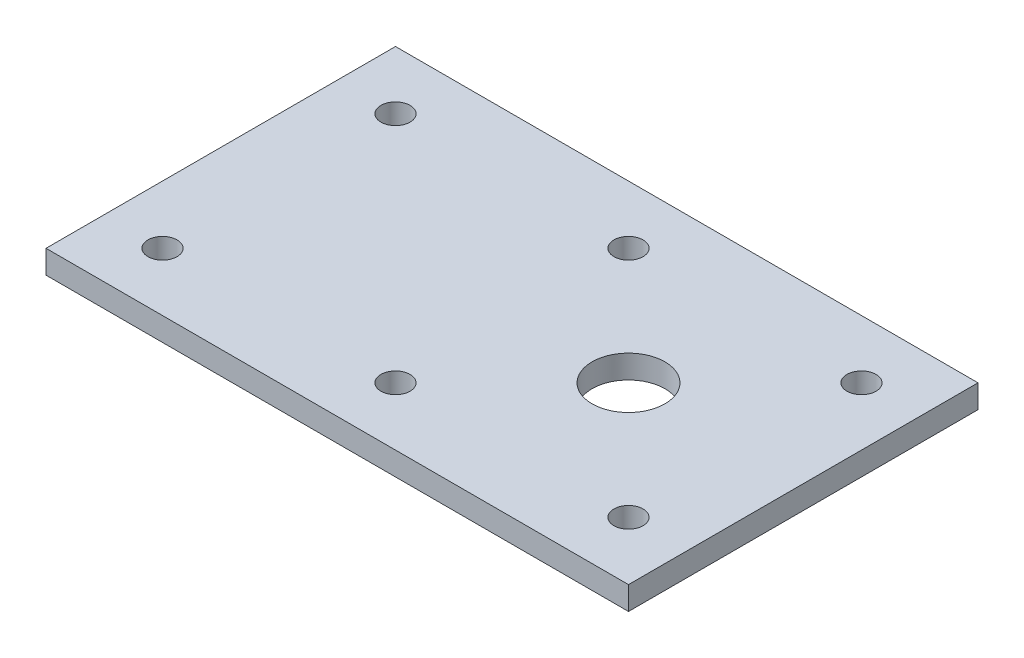
ISO-10303-21;
HEADER;
FILE_DESCRIPTION(('STEP AP214'),'2;1');
FILE_NAME('part.step','',(''),(''),'','','');
FILE_SCHEMA(('AUTOMOTIVE_DESIGN { 1 0 10303 214 1 1 1 1 }'));
ENDSEC;
DATA;
#1=APPLICATION_CONTEXT('core data for automotive mechanical design processes');
#2=APPLICATION_PROTOCOL_DEFINITION('international standard','automotive_design',2000,#1);
#3=PRODUCT_CONTEXT('',#1,'mechanical');
#4=PRODUCT('Part','Part','',(#3));
#5=PRODUCT_RELATED_PRODUCT_CATEGORY('part','',(#4));
#6=PRODUCT_DEFINITION_FORMATION('','',#4);
#7=PRODUCT_DEFINITION_CONTEXT('part definition',#1,'design');
#8=PRODUCT_DEFINITION('design','',#6,#7);
#9=PRODUCT_DEFINITION_SHAPE('','',#8);
#10=(LENGTH_UNIT() NAMED_UNIT(*) SI_UNIT(.MILLI.,.METRE.));
#11=(NAMED_UNIT(*) PLANE_ANGLE_UNIT() SI_UNIT($,.RADIAN.));
#12=(NAMED_UNIT(*) SI_UNIT($,.STERADIAN.) SOLID_ANGLE_UNIT());
#13=UNCERTAINTY_MEASURE_WITH_UNIT(LENGTH_MEASURE(1.E-05),#10,'distance_accuracy_value','');
#14=(GEOMETRIC_REPRESENTATION_CONTEXT(3) GLOBAL_UNCERTAINTY_ASSIGNED_CONTEXT((#13)) GLOBAL_UNIT_ASSIGNED_CONTEXT((#10,
#11,#12)) REPRESENTATION_CONTEXT('',''));
#15=CARTESIAN_POINT('',(0.,0.,0.));
#16=DIRECTION('',(0.,0.,1.));
#17=DIRECTION('',(1.,0.,0.));
#18=AXIS2_PLACEMENT_3D('',#15,#16,#17);
#19=CARTESIAN_POINT('',(89.6408317580341,0.,60.1134215500945));
#20=DIRECTION('',(0.,1.,0.));
#21=DIRECTION('',(0.,0.,1.));
#22=AXIS2_PLACEMENT_3D('',#19,#20,#21);
#23=CYLINDRICAL_SURFACE('',#22,5.);
#24=CARTESIAN_POINT('',(89.6408317580341,0.,60.1134215500945));
#25=DIRECTION('',(0.,1.,0.));
#26=DIRECTION('',(0.,0.,1.));
#27=AXIS2_PLACEMENT_3D('',#24,#25,#26);
#28=CIRCLE('',#27,5.);
#29=CARTESIAN_POINT('',(89.6408317580341,0.,65.1134215500945));
#30=VERTEX_POINT('',#29);
#31=EDGE_CURVE('E50',#30,#30,#28,.T.);
#32=ORIENTED_EDGE('',*,*,#31,.F.);
#33=EDGE_LOOP('',(#32));
#34=FACE_BOUND('',#33,.T.);
#35=CARTESIAN_POINT('',(89.6408317580341,7.99999999999999,60.1134215500945));
#36=DIRECTION('',(0.,1.,0.));
#37=DIRECTION('',(0.,0.,1.));
#38=AXIS2_PLACEMENT_3D('',#35,#36,#37);
#39=CIRCLE('',#38,5.);
#40=CARTESIAN_POINT('',(89.6408317580341,7.99999999999999,65.1134215500945));
#41=VERTEX_POINT('',#40);
#42=EDGE_CURVE('E11',#41,#41,#39,.T.);
#43=ORIENTED_EDGE('',*,*,#42,.T.);
#44=EDGE_LOOP('',(#43));
#45=FACE_BOUND('',#44,.T.);
#46=ADVANCED_FACE('F41',(#34,#45),#23,.F.);
#47=CARTESIAN_POINT('',(89.6408317580341,0.,-19.8865784499055));
#48=DIRECTION('',(0.,1.,0.));
#49=DIRECTION('',(0.,0.,1.));
#50=AXIS2_PLACEMENT_3D('',#47,#48,#49);
#51=CYLINDRICAL_SURFACE('',#50,5.);
#52=CARTESIAN_POINT('',(89.6408317580341,0.,-19.8865784499055));
#53=DIRECTION('',(0.,1.,0.));
#54=DIRECTION('',(0.,0.,1.));
#55=AXIS2_PLACEMENT_3D('',#52,#53,#54);
#56=CIRCLE('',#55,5.);
#57=CARTESIAN_POINT('',(89.6408317580341,0.,-14.8865784499055));
#58=VERTEX_POINT('',#57);
#59=EDGE_CURVE('E149',#58,#58,#56,.T.);
#60=ORIENTED_EDGE('',*,*,#59,.F.);
#61=EDGE_LOOP('',(#60));
#62=FACE_BOUND('',#61,.T.);
#63=CARTESIAN_POINT('',(89.6408317580341,7.99999999999999,-19.8865784499055));
#64=DIRECTION('',(0.,1.,0.));
#65=DIRECTION('',(0.,0.,1.));
#66=AXIS2_PLACEMENT_3D('',#63,#64,#65);
#67=CIRCLE('',#66,5.);
#68=CARTESIAN_POINT('',(89.6408317580341,7.99999999999999,-14.8865784499055));
#69=VERTEX_POINT('',#68);
#70=EDGE_CURVE('E153',#69,#69,#67,.T.);
#71=ORIENTED_EDGE('',*,*,#70,.T.);
#72=EDGE_LOOP('',(#71));
#73=FACE_BOUND('',#72,.T.);
#74=ADVANCED_FACE('F164',(#62,#73),#51,.F.);
#75=CARTESIAN_POINT('',(9.64083175803406,0.,60.1134215500945));
#76=DIRECTION('',(0.,1.,0.));
#77=DIRECTION('',(0.,0.,1.));
#78=AXIS2_PLACEMENT_3D('',#75,#76,#77);
#79=CYLINDRICAL_SURFACE('',#78,5.);
#80=CARTESIAN_POINT('',(9.64083175803406,0.,60.1134215500945));
#81=DIRECTION('',(0.,1.,0.));
#82=DIRECTION('',(0.,0.,1.));
#83=AXIS2_PLACEMENT_3D('',#80,#81,#82);
#84=CIRCLE('',#83,5.);
#85=CARTESIAN_POINT('',(9.64083175803406,0.,65.1134215500945));
#86=VERTEX_POINT('',#85);
#87=EDGE_CURVE('E141',#86,#86,#84,.T.);
#88=ORIENTED_EDGE('',*,*,#87,.F.);
#89=EDGE_LOOP('',(#88));
#90=FACE_BOUND('',#89,.T.);
#91=CARTESIAN_POINT('',(9.64083175803406,7.99999999999999,60.1134215500945));
#92=DIRECTION('',(0.,1.,0.));
#93=DIRECTION('',(0.,0.,1.));
#94=AXIS2_PLACEMENT_3D('',#91,#92,#93);
#95=CIRCLE('',#94,5.);
#96=CARTESIAN_POINT('',(9.64083175803406,7.99999999999999,65.1134215500945));
#97=VERTEX_POINT('',#96);
#98=EDGE_CURVE('E145',#97,#97,#95,.T.);
#99=ORIENTED_EDGE('',*,*,#98,.T.);
#100=EDGE_LOOP('',(#99));
#101=FACE_BOUND('',#100,.T.);
#102=ADVANCED_FACE('F194',(#90,#101),#79,.F.);
#103=CARTESIAN_POINT('',(9.64083175803404,0.,-19.8865784499055));
#104=DIRECTION('',(0.,1.,0.));
#105=DIRECTION('',(0.,0.,1.));
#106=AXIS2_PLACEMENT_3D('',#103,#104,#105);
#107=CYLINDRICAL_SURFACE('',#106,5.);
#108=CARTESIAN_POINT('',(9.64083175803404,0.,-19.8865784499055));
#109=DIRECTION('',(0.,1.,0.));
#110=DIRECTION('',(0.,0.,1.));
#111=AXIS2_PLACEMENT_3D('',#108,#109,#110);
#112=CIRCLE('',#111,5.);
#113=CARTESIAN_POINT('',(9.64083175803404,0.,-14.8865784499055));
#114=VERTEX_POINT('',#113);
#115=EDGE_CURVE('E133',#114,#114,#112,.T.);
#116=ORIENTED_EDGE('',*,*,#115,.F.);
#117=EDGE_LOOP('',(#116));
#118=FACE_BOUND('',#117,.T.);
#119=CARTESIAN_POINT('',(9.64083175803404,7.99999999999999,-19.8865784499055));
#120=DIRECTION('',(0.,1.,0.));
#121=DIRECTION('',(0.,0.,1.));
#122=AXIS2_PLACEMENT_3D('',#119,#120,#121);
#123=CIRCLE('',#122,5.);
#124=CARTESIAN_POINT('',(9.64083175803404,7.99999999999999,-14.8865784499055));
#125=VERTEX_POINT('',#124);
#126=EDGE_CURVE('E137',#125,#125,#123,.T.);
#127=ORIENTED_EDGE('',*,*,#126,.T.);
#128=EDGE_LOOP('',(#127));
#129=FACE_BOUND('',#128,.T.);
#130=ADVANCED_FACE('F191',(#118,#129),#107,.F.);
#131=CARTESIAN_POINT('',(-90.359168241966,7.99999999999999,-39.8865784499055));
#132=DIRECTION('',(1.,0.,0.));
#133=DIRECTION('',(0.,0.,-1.));
#134=AXIS2_PLACEMENT_3D('',#131,#132,#133);
#135=PLANE('',#134);
#136=DIRECTION('',(0.,0.,1.));
#137=VECTOR('',#136,1.);
#138=CARTESIAN_POINT('',(-90.359168241966,0.,-39.8865784499055));
#139=LINE('',#138,#137);
#140=CARTESIAN_POINT('',(-90.359168241966,0.,-39.8865784499055));
#141=VERTEX_POINT('',#140);
#142=CARTESIAN_POINT('',(-90.3591682419659,0.,80.1134215500945));
#143=VERTEX_POINT('',#142);
#144=EDGE_CURVE('E114',#141,#143,#139,.T.);
#145=ORIENTED_EDGE('',*,*,#144,.T.);
#146=DIRECTION('',(0.,-1.,0.));
#147=VECTOR('',#146,1.);
#148=CARTESIAN_POINT('',(-90.3591682419659,7.99999999999999,80.1134215500945));
#149=LINE('',#148,#147);
#150=CARTESIAN_POINT('',(-90.3591682419659,7.99999999999999,80.1134215500945));
#151=VERTEX_POINT('',#150);
#152=EDGE_CURVE('E104',#151,#143,#149,.T.);
#153=ORIENTED_EDGE('',*,*,#152,.F.);
#154=DIRECTION('',(0.,0.,1.));
#155=VECTOR('',#154,1.);
#156=CARTESIAN_POINT('',(-90.359168241966,7.99999999999999,-39.8865784499055));
#157=LINE('',#156,#155);
#158=CARTESIAN_POINT('',(-90.359168241966,7.99999999999999,-39.8865784499055));
#159=VERTEX_POINT('',#158);
#160=EDGE_CURVE('E93',#159,#151,#157,.T.);
#161=ORIENTED_EDGE('',*,*,#160,.F.);
#162=DIRECTION('',(0.,-1.,0.));
#163=VECTOR('',#162,1.);
#164=CARTESIAN_POINT('',(-90.359168241966,7.99999999999999,-39.8865784499055));
#165=LINE('',#164,#163);
#166=EDGE_CURVE('E58',#159,#141,#165,.T.);
#167=ORIENTED_EDGE('',*,*,#166,.T.);
#168=EDGE_LOOP('',(#145,#153,#161,#167));
#169=FACE_BOUND('',#168,.T.);
#170=ADVANCED_FACE('F188',(#169),#135,.F.);
#171=CARTESIAN_POINT('',(-90.3591682419659,7.99999999999999,80.1134215500945));
#172=DIRECTION('',(0.,0.,-1.));
#173=DIRECTION('',(-1.,0.,0.));
#174=AXIS2_PLACEMENT_3D('',#171,#172,#173);
#175=PLANE('',#174);
#176=DIRECTION('',(1.,0.,0.));
#177=VECTOR('',#176,1.);
#178=CARTESIAN_POINT('',(-90.3591682419659,0.,80.1134215500945));
#179=LINE('',#178,#177);
#180=CARTESIAN_POINT('',(109.640831758034,0.,80.1134215500945));
#181=VERTEX_POINT('',#180);
#182=EDGE_CURVE('E100',#143,#181,#179,.T.);
#183=ORIENTED_EDGE('',*,*,#182,.T.);
#184=DIRECTION('',(0.,-1.,0.));
#185=VECTOR('',#184,1.);
#186=CARTESIAN_POINT('',(109.640831758034,7.99999999999999,80.1134215500945));
#187=LINE('',#186,#185);
#188=CARTESIAN_POINT('',(109.640831758034,7.99999999999999,80.1134215500945));
#189=VERTEX_POINT('',#188);
#190=EDGE_CURVE('E98',#189,#181,#187,.T.);
#191=ORIENTED_EDGE('',*,*,#190,.F.);
#192=DIRECTION('',(1.,0.,0.));
#193=VECTOR('',#192,1.);
#194=CARTESIAN_POINT('',(-90.3591682419659,7.99999999999999,80.1134215500945));
#195=LINE('',#194,#193);
#196=EDGE_CURVE('E84',#151,#189,#195,.T.);
#197=ORIENTED_EDGE('',*,*,#196,.F.);
#198=ORIENTED_EDGE('',*,*,#152,.T.);
#199=EDGE_LOOP('',(#183,#191,#197,#198));
#200=FACE_BOUND('',#199,.T.);
#201=ADVANCED_FACE('F99',(#200),#175,.F.);
#202=CARTESIAN_POINT('',(109.640831758034,7.99999999999999,-39.8865784499055));
#203=DIRECTION('',(1.,0.,0.));
#204=DIRECTION('',(0.,0.,-1.));
#205=AXIS2_PLACEMENT_3D('',#202,#203,#204);
#206=PLANE('',#205);
#207=DIRECTION('',(0.,0.,1.));
#208=VECTOR('',#207,1.);
#209=CARTESIAN_POINT('',(109.640831758034,0.,-39.8865784499055));
#210=LINE('',#209,#208);
#211=CARTESIAN_POINT('',(109.640831758034,0.,-39.8865784499055));
#212=VERTEX_POINT('',#211);
#213=EDGE_CURVE('E120',#212,#181,#210,.T.);
#214=ORIENTED_EDGE('',*,*,#213,.F.);
#215=DIRECTION('',(0.,-1.,0.));
#216=VECTOR('',#215,1.);
#217=CARTESIAN_POINT('',(109.640831758034,7.99999999999999,-39.8865784499055));
#218=LINE('',#217,#216);
#219=CARTESIAN_POINT('',(109.640831758034,7.99999999999999,-39.8865784499055));
#220=VERTEX_POINT('',#219);
#221=EDGE_CURVE('E72',#220,#212,#218,.T.);
#222=ORIENTED_EDGE('',*,*,#221,.F.);
#223=DIRECTION('',(0.,0.,1.));
#224=VECTOR('',#223,1.);
#225=CARTESIAN_POINT('',(109.640831758034,7.99999999999999,-39.8865784499055));
#226=LINE('',#225,#224);
#227=EDGE_CURVE('E92',#220,#189,#226,.T.);
#228=ORIENTED_EDGE('',*,*,#227,.T.);
#229=ORIENTED_EDGE('',*,*,#190,.T.);
#230=EDGE_LOOP('',(#214,#222,#228,#229));
#231=FACE_BOUND('',#230,.T.);
#232=ADVANCED_FACE('F106',(#231),#206,.T.);
#233=CARTESIAN_POINT('',(-90.359168241966,7.99999999999999,-39.8865784499055));
#234=DIRECTION('',(0.,0.,-1.));
#235=DIRECTION('',(-1.,0.,0.));
#236=AXIS2_PLACEMENT_3D('',#233,#234,#235);
#237=PLANE('',#236);
#238=DIRECTION('',(1.,0.,0.));
#239=VECTOR('',#238,1.);
#240=CARTESIAN_POINT('',(-90.359168241966,0.,-39.8865784499055));
#241=LINE('',#240,#239);
#242=EDGE_CURVE('E123',#141,#212,#241,.T.);
#243=ORIENTED_EDGE('',*,*,#242,.F.);
#244=ORIENTED_EDGE('',*,*,#166,.F.);
#245=DIRECTION('',(1.,0.,0.));
#246=VECTOR('',#245,1.);
#247=CARTESIAN_POINT('',(-90.359168241966,7.99999999999999,-39.8865784499055));
#248=LINE('',#247,#246);
#249=EDGE_CURVE('E108',#159,#220,#248,.T.);
#250=ORIENTED_EDGE('',*,*,#249,.T.);
#251=ORIENTED_EDGE('',*,*,#221,.T.);
#252=EDGE_LOOP('',(#243,#244,#250,#251));
#253=FACE_BOUND('',#252,.T.);
#254=ADVANCED_FACE('F168',(#253),#237,.T.);
#255=CARTESIAN_POINT('',(0.,7.99999999999999,0.));
#256=DIRECTION('',(0.,1.,0.));
#257=DIRECTION('',(0.,0.,1.));
#258=AXIS2_PLACEMENT_3D('',#255,#256,#257);
#259=PLANE('',#258);
#260=CARTESIAN_POINT('',(49.640831758034,7.99999999999999,20.1134215500945));
#261=DIRECTION('',(0.,1.,0.));
#262=DIRECTION('',(0.,0.,1.));
#263=AXIS2_PLACEMENT_3D('',#260,#261,#262);
#264=CIRCLE('',#263,12.5);
#265=CARTESIAN_POINT('',(49.640831758034,7.99999999999999,32.6134215500945));
#266=VERTEX_POINT('',#265);
#267=EDGE_CURVE('E286',#266,#266,#264,.T.);
#268=ORIENTED_EDGE('',*,*,#267,.F.);
#269=EDGE_LOOP('',(#268));
#270=FACE_BOUND('',#269,.T.);
#271=CARTESIAN_POINT('',(-70.3591682419659,7.99999999999999,60.1134215500945));
#272=DIRECTION('',(0.,1.,0.));
#273=DIRECTION('',(0.,0.,1.));
#274=AXIS2_PLACEMENT_3D('',#271,#272,#273);
#275=CIRCLE('',#274,5.);
#276=CARTESIAN_POINT('',(-70.3591682419659,7.99999999999999,65.1134215500945));
#277=VERTEX_POINT('',#276);
#278=EDGE_CURVE('E299',#277,#277,#275,.T.);
#279=ORIENTED_EDGE('',*,*,#278,.F.);
#280=EDGE_LOOP('',(#279));
#281=FACE_BOUND('',#280,.T.);
#282=CARTESIAN_POINT('',(-70.359168241966,7.99999999999999,-19.8865784499055));
#283=DIRECTION('',(0.,1.,0.));
#284=DIRECTION('',(0.,0.,1.));
#285=AXIS2_PLACEMENT_3D('',#282,#283,#284);
#286=CIRCLE('',#285,5.);
#287=CARTESIAN_POINT('',(-70.359168241966,7.99999999999999,-14.8865784499055));
#288=VERTEX_POINT('',#287);
#289=EDGE_CURVE('E303',#288,#288,#286,.T.);
#290=ORIENTED_EDGE('',*,*,#289,.F.);
#291=EDGE_LOOP('',(#290));
#292=FACE_BOUND('',#291,.T.);
#293=ORIENTED_EDGE('',*,*,#160,.T.);
#294=ORIENTED_EDGE('',*,*,#196,.T.);
#295=ORIENTED_EDGE('',*,*,#227,.F.);
#296=ORIENTED_EDGE('',*,*,#249,.F.);
#297=EDGE_LOOP('',(#293,#294,#295,#296));
#298=FACE_BOUND('',#297,.T.);
#299=ORIENTED_EDGE('',*,*,#126,.F.);
#300=EDGE_LOOP('',(#299));
#301=FACE_BOUND('',#300,.T.);
#302=ORIENTED_EDGE('',*,*,#98,.F.);
#303=EDGE_LOOP('',(#302));
#304=FACE_BOUND('',#303,.T.);
#305=ORIENTED_EDGE('',*,*,#70,.F.);
#306=EDGE_LOOP('',(#305));
#307=FACE_BOUND('',#306,.T.);
#308=ORIENTED_EDGE('',*,*,#42,.F.);
#309=EDGE_LOOP('',(#308));
#310=FACE_BOUND('',#309,.T.);
#311=ADVANCED_FACE('F88',(#270,#281,#292,#298,#301,#304,#307,#310),#259,.T.);
#312=CARTESIAN_POINT('',(0.,0.,0.));
#313=DIRECTION('',(0.,1.,0.));
#314=DIRECTION('',(0.,0.,1.));
#315=AXIS2_PLACEMENT_3D('',#312,#313,#314);
#316=PLANE('',#315);
#317=CARTESIAN_POINT('',(49.640831758034,0.,20.1134215500945));
#318=DIRECTION('',(0.,-1.,0.));
#319=DIRECTION('',(0.,0.,-1.));
#320=AXIS2_PLACEMENT_3D('',#317,#318,#319);
#321=CIRCLE('',#320,12.5);
#322=CARTESIAN_POINT('',(49.640831758034,0.,7.61342155009452));
#323=VERTEX_POINT('',#322);
#324=EDGE_CURVE('E289',#323,#323,#321,.T.);
#325=ORIENTED_EDGE('',*,*,#324,.F.);
#326=EDGE_LOOP('',(#325));
#327=FACE_BOUND('',#326,.T.);
#328=CARTESIAN_POINT('',(-70.3591682419659,0.,60.1134215500945));
#329=DIRECTION('',(0.,1.,0.));
#330=DIRECTION('',(0.,0.,1.));
#331=AXIS2_PLACEMENT_3D('',#328,#329,#330);
#332=CIRCLE('',#331,5.);
#333=CARTESIAN_POINT('',(-70.3591682419659,0.,65.1134215500945));
#334=VERTEX_POINT('',#333);
#335=EDGE_CURVE('E293',#334,#334,#332,.T.);
#336=ORIENTED_EDGE('',*,*,#335,.T.);
#337=EDGE_LOOP('',(#336));
#338=FACE_BOUND('',#337,.T.);
#339=CARTESIAN_POINT('',(-70.359168241966,0.,-19.8865784499055));
#340=DIRECTION('',(0.,1.,0.));
#341=DIRECTION('',(0.,0.,1.));
#342=AXIS2_PLACEMENT_3D('',#339,#340,#341);
#343=CIRCLE('',#342,5.);
#344=CARTESIAN_POINT('',(-70.359168241966,0.,-14.8865784499055));
#345=VERTEX_POINT('',#344);
#346=EDGE_CURVE('E117',#345,#345,#343,.T.);
#347=ORIENTED_EDGE('',*,*,#346,.T.);
#348=EDGE_LOOP('',(#347));
#349=FACE_BOUND('',#348,.T.);
#350=ORIENTED_EDGE('',*,*,#144,.F.);
#351=ORIENTED_EDGE('',*,*,#242,.T.);
#352=ORIENTED_EDGE('',*,*,#213,.T.);
#353=ORIENTED_EDGE('',*,*,#182,.F.);
#354=EDGE_LOOP('',(#350,#351,#352,#353));
#355=FACE_BOUND('',#354,.T.);
#356=ORIENTED_EDGE('',*,*,#115,.T.);
#357=EDGE_LOOP('',(#356));
#358=FACE_BOUND('',#357,.T.);
#359=ORIENTED_EDGE('',*,*,#87,.T.);
#360=EDGE_LOOP('',(#359));
#361=FACE_BOUND('',#360,.T.);
#362=ORIENTED_EDGE('',*,*,#59,.T.);
#363=EDGE_LOOP('',(#362));
#364=FACE_BOUND('',#363,.T.);
#365=ORIENTED_EDGE('',*,*,#31,.T.);
#366=EDGE_LOOP('',(#365));
#367=FACE_BOUND('',#366,.T.);
#368=ADVANCED_FACE('F160',(#327,#338,#349,#355,#358,#361,#364,#367),#316,.F.);
#369=CARTESIAN_POINT('',(-70.359168241966,0.,-19.8865784499055));
#370=DIRECTION('',(0.,1.,0.));
#371=DIRECTION('',(0.,0.,1.));
#372=AXIS2_PLACEMENT_3D('',#369,#370,#371);
#373=CYLINDRICAL_SURFACE('',#372,5.);
#374=ORIENTED_EDGE('',*,*,#346,.F.);
#375=EDGE_LOOP('',(#374));
#376=FACE_BOUND('',#375,.T.);
#377=ORIENTED_EDGE('',*,*,#289,.T.);
#378=EDGE_LOOP('',(#377));
#379=FACE_BOUND('',#378,.T.);
#380=ADVANCED_FACE('F175',(#376,#379),#373,.F.);
#381=CARTESIAN_POINT('',(-70.3591682419659,0.,60.1134215500945));
#382=DIRECTION('',(0.,1.,0.));
#383=DIRECTION('',(0.,0.,1.));
#384=AXIS2_PLACEMENT_3D('',#381,#382,#383);
#385=CYLINDRICAL_SURFACE('',#384,5.);
#386=ORIENTED_EDGE('',*,*,#335,.F.);
#387=EDGE_LOOP('',(#386));
#388=FACE_BOUND('',#387,.T.);
#389=ORIENTED_EDGE('',*,*,#278,.T.);
#390=EDGE_LOOP('',(#389));
#391=FACE_BOUND('',#390,.T.);
#392=ADVANCED_FACE('F243',(#388,#391),#385,.F.);
#393=CARTESIAN_POINT('',(49.640831758034,50.,20.1134215500945));
#394=DIRECTION('',(0.,-1.,0.));
#395=DIRECTION('',(0.,0.,-1.));
#396=AXIS2_PLACEMENT_3D('',#393,#394,#395);
#397=CYLINDRICAL_SURFACE('',#396,12.5);
#398=ORIENTED_EDGE('',*,*,#267,.T.);
#399=EDGE_LOOP('',(#398));
#400=FACE_BOUND('',#399,.T.);
#401=ORIENTED_EDGE('',*,*,#324,.T.);
#402=EDGE_LOOP('',(#401));
#403=FACE_BOUND('',#402,.T.);
#404=ADVANCED_FACE('F264',(#400,#403),#397,.F.);
#405=CLOSED_SHELL('',(#46,#74,#102,#130,#170,#201,#232,#254,#311,#368,#380,#392,#404));
#406=MANIFOLD_SOLID_BREP('B2',#405);
#407=ADVANCED_BREP_SHAPE_REPRESENTATION('',(#18,#406),#14);
#408=SHAPE_DEFINITION_REPRESENTATION(#9,#407);
ENDSEC;
END-ISO-10303-21;
